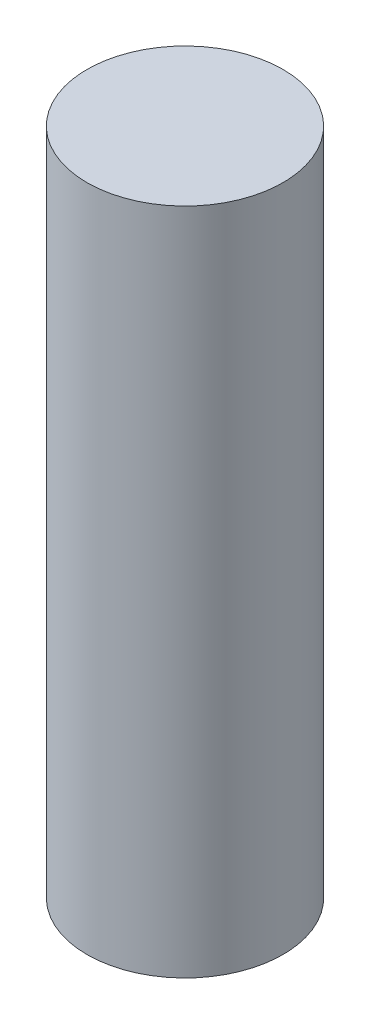
ISO-10303-21;
HEADER;
FILE_DESCRIPTION(('STEP AP214'),'2;1');
FILE_NAME('part.step','',(''),(''),'','','');
FILE_SCHEMA(('AUTOMOTIVE_DESIGN { 1 0 10303 214 1 1 1 1 }'));
ENDSEC;
DATA;
#1=APPLICATION_CONTEXT('core data for automotive mechanical design processes');
#2=APPLICATION_PROTOCOL_DEFINITION('international standard','automotive_design',2000,#1);
#3=PRODUCT_CONTEXT('',#1,'mechanical');
#4=PRODUCT('Part','Part','',(#3));
#5=PRODUCT_RELATED_PRODUCT_CATEGORY('part','',(#4));
#6=PRODUCT_DEFINITION_FORMATION('','',#4);
#7=PRODUCT_DEFINITION_CONTEXT('part definition',#1,'design');
#8=PRODUCT_DEFINITION('design','',#6,#7);
#9=PRODUCT_DEFINITION_SHAPE('','',#8);
#10=(LENGTH_UNIT() NAMED_UNIT(*) SI_UNIT(.MILLI.,.METRE.));
#11=(NAMED_UNIT(*) PLANE_ANGLE_UNIT() SI_UNIT($,.RADIAN.));
#12=(NAMED_UNIT(*) SI_UNIT($,.STERADIAN.) SOLID_ANGLE_UNIT());
#13=UNCERTAINTY_MEASURE_WITH_UNIT(LENGTH_MEASURE(1.E-05),#10,'distance_accuracy_value','');
#14=(GEOMETRIC_REPRESENTATION_CONTEXT(3) GLOBAL_UNCERTAINTY_ASSIGNED_CONTEXT((#13)) GLOBAL_UNIT_ASSIGNED_CONTEXT((#10,
#11,#12)) REPRESENTATION_CONTEXT('',''));
#15=CARTESIAN_POINT('',(0.,0.,0.));
#16=DIRECTION('',(0.,0.,1.));
#17=DIRECTION('',(1.,0.,0.));
#18=AXIS2_PLACEMENT_3D('',#15,#16,#17);
#19=CARTESIAN_POINT('',(0.,45.,0.));
#20=DIRECTION('',(0.,-1.,0.));
#21=DIRECTION('',(0.,0.,-1.));
#22=AXIS2_PLACEMENT_3D('',#19,#20,#21);
#23=CYLINDRICAL_SURFACE('',#22,6.6);
#24=CARTESIAN_POINT('',(0.,45.,0.));
#25=DIRECTION('',(0.,1.,0.));
#26=DIRECTION('',(0.,0.,1.));
#27=AXIS2_PLACEMENT_3D('',#24,#25,#26);
#28=CIRCLE('',#27,6.6);
#29=CARTESIAN_POINT('',(0.,45.,6.6));
#30=VERTEX_POINT('',#29);
#31=EDGE_CURVE('E10',#30,#30,#28,.T.);
#32=ORIENTED_EDGE('',*,*,#31,.F.);
#33=EDGE_LOOP('',(#32));
#34=FACE_BOUND('',#33,.T.);
#35=CARTESIAN_POINT('',(0.,0.,0.));
#36=DIRECTION('',(0.,1.,0.));
#37=DIRECTION('',(0.,0.,1.));
#38=AXIS2_PLACEMENT_3D('',#35,#36,#37);
#39=CIRCLE('',#38,6.6);
#40=CARTESIAN_POINT('',(0.,0.,6.6));
#41=VERTEX_POINT('',#40);
#42=EDGE_CURVE('E42',#41,#41,#39,.T.);
#43=ORIENTED_EDGE('',*,*,#42,.T.);
#44=EDGE_LOOP('',(#43));
#45=FACE_BOUND('',#44,.T.);
#46=ADVANCED_FACE('F39',(#34,#45),#23,.T.);
#47=CARTESIAN_POINT('',(0.,45.,0.));
#48=DIRECTION('',(0.,1.,0.));
#49=DIRECTION('',(0.,0.,1.));
#50=AXIS2_PLACEMENT_3D('',#47,#48,#49);
#51=PLANE('',#50);
#52=ORIENTED_EDGE('',*,*,#31,.T.);
#53=EDGE_LOOP('',(#52));
#54=FACE_BOUND('',#53,.T.);
#55=ADVANCED_FACE('F54',(#54),#51,.T.);
#56=CARTESIAN_POINT('',(0.,0.,0.));
#57=DIRECTION('',(0.,1.,0.));
#58=DIRECTION('',(0.,0.,1.));
#59=AXIS2_PLACEMENT_3D('',#56,#57,#58);
#60=PLANE('',#59);
#61=ORIENTED_EDGE('',*,*,#42,.F.);
#62=EDGE_LOOP('',(#61));
#63=FACE_BOUND('',#62,.T.);
#64=ADVANCED_FACE('F52',(#63),#60,.F.);
#65=CLOSED_SHELL('',(#46,#55,#64));
#66=MANIFOLD_SOLID_BREP('B2',#65);
#67=ADVANCED_BREP_SHAPE_REPRESENTATION('',(#18,#66),#14);
#68=SHAPE_DEFINITION_REPRESENTATION(#9,#67);
ENDSEC;
END-ISO-10303-21;
